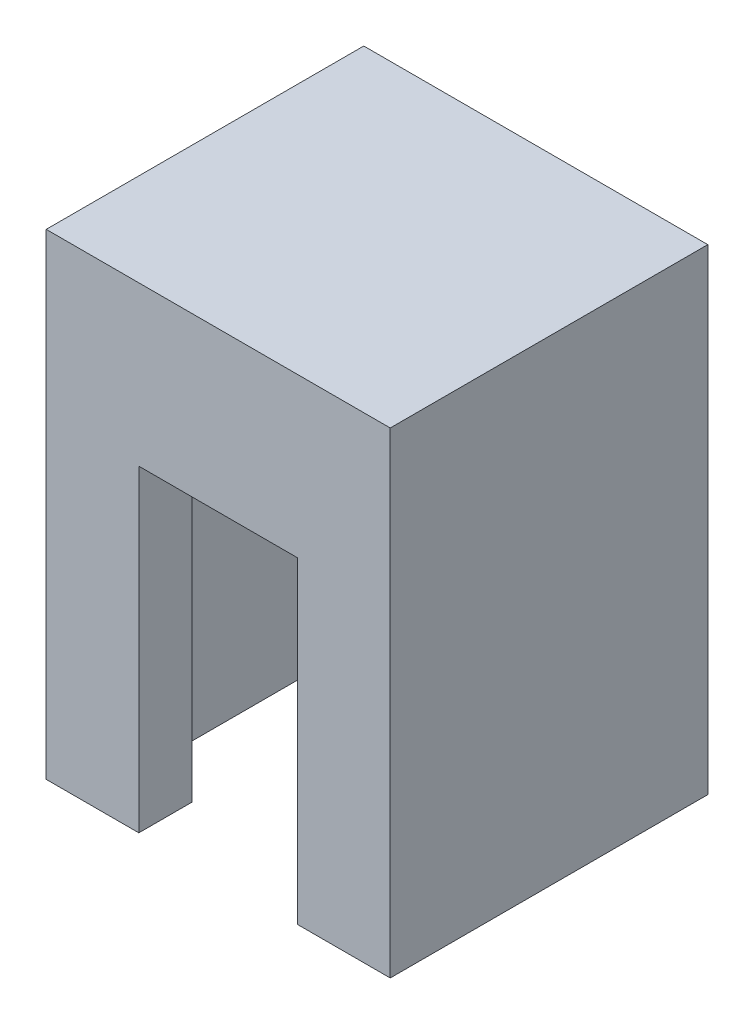
ISO-10303-21;
HEADER;
FILE_DESCRIPTION(('STEP AP214'),'2;1');
FILE_NAME('part.step','',(''),(''),'','','');
FILE_SCHEMA(('AUTOMOTIVE_DESIGN { 1 0 10303 214 1 1 1 1 }'));
ENDSEC;
DATA;
#1=APPLICATION_CONTEXT('core data for automotive mechanical design processes');
#2=APPLICATION_PROTOCOL_DEFINITION('international standard','automotive_design',2000,#1);
#3=PRODUCT_CONTEXT('',#1,'mechanical');
#4=PRODUCT('Part','Part','',(#3));
#5=PRODUCT_RELATED_PRODUCT_CATEGORY('part','',(#4));
#6=PRODUCT_DEFINITION_FORMATION('','',#4);
#7=PRODUCT_DEFINITION_CONTEXT('part definition',#1,'design');
#8=PRODUCT_DEFINITION('design','',#6,#7);
#9=PRODUCT_DEFINITION_SHAPE('','',#8);
#10=(LENGTH_UNIT() NAMED_UNIT(*) SI_UNIT(.MILLI.,.METRE.));
#11=(NAMED_UNIT(*) PLANE_ANGLE_UNIT() SI_UNIT($,.RADIAN.));
#12=(NAMED_UNIT(*) SI_UNIT($,.STERADIAN.) SOLID_ANGLE_UNIT());
#13=UNCERTAINTY_MEASURE_WITH_UNIT(LENGTH_MEASURE(1.E-05),#10,'distance_accuracy_value','');
#14=(GEOMETRIC_REPRESENTATION_CONTEXT(3) GLOBAL_UNCERTAINTY_ASSIGNED_CONTEXT((#13)) GLOBAL_UNIT_ASSIGNED_CONTEXT((#10,
#11,#12)) REPRESENTATION_CONTEXT('',''));
#15=CARTESIAN_POINT('',(0.,0.,0.));
#16=DIRECTION('',(0.,0.,1.));
#17=DIRECTION('',(1.,0.,0.));
#18=AXIS2_PLACEMENT_3D('',#15,#16,#17);
#19=CARTESIAN_POINT('',(-6.5,-9.,12.));
#20=DIRECTION('',(0.,1.,0.));
#21=DIRECTION('',(0.,0.,1.));
#22=AXIS2_PLACEMENT_3D('',#19,#20,#21);
#23=PLANE('',#22);
#24=DIRECTION('',(1.,0.,0.));
#25=VECTOR('',#24,1.);
#26=CARTESIAN_POINT('',(-6.5,-9.,0.));
#27=LINE('',#26,#25);
#28=CARTESIAN_POINT('',(-6.5,-9.,0.));
#29=VERTEX_POINT('',#28);
#30=CARTESIAN_POINT('',(-3.,-9.,0.));
#31=VERTEX_POINT('',#30);
#32=EDGE_CURVE('E255',#29,#31,#27,.T.);
#33=ORIENTED_EDGE('',*,*,#32,.T.);
#34=DIRECTION('',(0.,0.,-1.));
#35=VECTOR('',#34,1.);
#36=CARTESIAN_POINT('',(-3.,-9.,2.));
#37=LINE('',#36,#35);
#38=CARTESIAN_POINT('',(-3.,-9.,2.));
#39=VERTEX_POINT('',#38);
#40=EDGE_CURVE('E223',#39,#31,#37,.T.);
#41=ORIENTED_EDGE('',*,*,#40,.F.);
#42=DIRECTION('',(1.,0.,0.));
#43=VECTOR('',#42,1.);
#44=CARTESIAN_POINT('',(-5.,-9.,2.));
#45=LINE('',#44,#43);
#46=CARTESIAN_POINT('',(-5.,-9.,2.));
#47=VERTEX_POINT('',#46);
#48=EDGE_CURVE('E220',#47,#39,#45,.T.);
#49=ORIENTED_EDGE('',*,*,#48,.F.);
#50=DIRECTION('',(0.,0.,-1.));
#51=VECTOR('',#50,1.);
#52=CARTESIAN_POINT('',(-5.,-9.,2.));
#53=LINE('',#52,#51);
#54=CARTESIAN_POINT('',(-5.,-9.,10.));
#55=VERTEX_POINT('',#54);
#56=EDGE_CURVE('E217',#55,#47,#53,.T.);
#57=ORIENTED_EDGE('',*,*,#56,.F.);
#58=DIRECTION('',(-1.,0.,0.));
#59=VECTOR('',#58,1.);
#60=CARTESIAN_POINT('',(-5.,-9.,10.));
#61=LINE('',#60,#59);
#62=CARTESIAN_POINT('',(-3.,-9.,10.));
#63=VERTEX_POINT('',#62);
#64=EDGE_CURVE('E214',#63,#55,#61,.T.);
#65=ORIENTED_EDGE('',*,*,#64,.F.);
#66=DIRECTION('',(0.,0.,-1.));
#67=VECTOR('',#66,1.);
#68=CARTESIAN_POINT('',(-3.,-9.,10.));
#69=LINE('',#68,#67);
#70=CARTESIAN_POINT('',(-3.,-9.,12.));
#71=VERTEX_POINT('',#70);
#72=EDGE_CURVE('E211',#71,#63,#69,.T.);
#73=ORIENTED_EDGE('',*,*,#72,.F.);
#74=DIRECTION('',(1.,0.,0.));
#75=VECTOR('',#74,1.);
#76=CARTESIAN_POINT('',(-6.5,-9.,12.));
#77=LINE('',#76,#75);
#78=CARTESIAN_POINT('',(-6.5,-9.,12.));
#79=VERTEX_POINT('',#78);
#80=EDGE_CURVE('E259',#79,#71,#77,.T.);
#81=ORIENTED_EDGE('',*,*,#80,.F.);
#82=DIRECTION('',(0.,0.,-1.));
#83=VECTOR('',#82,1.);
#84=CARTESIAN_POINT('',(-6.5,-9.,12.));
#85=LINE('',#84,#83);
#86=EDGE_CURVE('E272',#79,#29,#85,.T.);
#87=ORIENTED_EDGE('',*,*,#86,.T.);
#88=EDGE_LOOP('',(#33,#41,#49,#57,#65,#73,#81,#87));
#89=FACE_BOUND('',#88,.T.);
#90=ADVANCED_FACE('F33',(#89),#23,.F.);
#91=CARTESIAN_POINT('',(6.5,-9.,12.));
#92=DIRECTION('',(-1.,0.,0.));
#93=DIRECTION('',(0.,0.,1.));
#94=AXIS2_PLACEMENT_3D('',#91,#92,#93);
#95=PLANE('',#94);
#96=DIRECTION('',(0.,1.,0.));
#97=VECTOR('',#96,1.);
#98=CARTESIAN_POINT('',(6.5,-9.,0.));
#99=LINE('',#98,#97);
#100=CARTESIAN_POINT('',(6.5,-9.,0.));
#101=VERTEX_POINT('',#100);
#102=CARTESIAN_POINT('',(6.5,9.,0.));
#103=VERTEX_POINT('',#102);
#104=EDGE_CURVE('E232',#101,#103,#99,.T.);
#105=ORIENTED_EDGE('',*,*,#104,.T.);
#106=DIRECTION('',(0.,0.,-1.));
#107=VECTOR('',#106,1.);
#108=CARTESIAN_POINT('',(6.5,9.,12.));
#109=LINE('',#108,#107);
#110=CARTESIAN_POINT('',(6.5,9.,12.));
#111=VERTEX_POINT('',#110);
#112=EDGE_CURVE('E11',#111,#103,#109,.T.);
#113=ORIENTED_EDGE('',*,*,#112,.F.);
#114=DIRECTION('',(0.,1.,0.));
#115=VECTOR('',#114,1.);
#116=CARTESIAN_POINT('',(6.5,-9.,12.));
#117=LINE('',#116,#115);
#118=CARTESIAN_POINT('',(6.5,-9.,12.));
#119=VERTEX_POINT('',#118);
#120=EDGE_CURVE('E253',#119,#111,#117,.T.);
#121=ORIENTED_EDGE('',*,*,#120,.F.);
#122=DIRECTION('',(0.,0.,-1.));
#123=VECTOR('',#122,1.);
#124=CARTESIAN_POINT('',(6.5,-9.,12.));
#125=LINE('',#124,#123);
#126=EDGE_CURVE('E262',#119,#101,#125,.T.);
#127=ORIENTED_EDGE('',*,*,#126,.T.);
#128=EDGE_LOOP('',(#105,#113,#121,#127));
#129=FACE_BOUND('',#128,.T.);
#130=ADVANCED_FACE('F35',(#129),#95,.F.);
#131=CARTESIAN_POINT('',(-6.5,9.,12.));
#132=DIRECTION('',(0.,-1.,0.));
#133=DIRECTION('',(0.,0.,-1.));
#134=AXIS2_PLACEMENT_3D('',#131,#132,#133);
#135=PLANE('',#134);
#136=DIRECTION('',(-1.,0.,0.));
#137=VECTOR('',#136,1.);
#138=CARTESIAN_POINT('',(-6.5,9.,0.));
#139=LINE('',#138,#137);
#140=CARTESIAN_POINT('',(-6.5,9.,0.));
#141=VERTEX_POINT('',#140);
#142=EDGE_CURVE('E265',#103,#141,#139,.T.);
#143=ORIENTED_EDGE('',*,*,#142,.T.);
#144=DIRECTION('',(0.,0.,-1.));
#145=VECTOR('',#144,1.);
#146=CARTESIAN_POINT('',(-6.5,9.,12.));
#147=LINE('',#146,#145);
#148=CARTESIAN_POINT('',(-6.5,9.,12.));
#149=VERTEX_POINT('',#148);
#150=EDGE_CURVE('E41',#149,#141,#147,.T.);
#151=ORIENTED_EDGE('',*,*,#150,.F.);
#152=DIRECTION('',(-1.,0.,0.));
#153=VECTOR('',#152,1.);
#154=CARTESIAN_POINT('',(-6.5,9.,12.));
#155=LINE('',#154,#153);
#156=EDGE_CURVE('E86',#111,#149,#155,.T.);
#157=ORIENTED_EDGE('',*,*,#156,.F.);
#158=ORIENTED_EDGE('',*,*,#112,.T.);
#159=EDGE_LOOP('',(#143,#151,#157,#158));
#160=FACE_BOUND('',#159,.T.);
#161=ADVANCED_FACE('F297',(#160),#135,.F.);
#162=CARTESIAN_POINT('',(-6.5,-9.,12.));
#163=DIRECTION('',(1.,0.,0.));
#164=DIRECTION('',(0.,0.,-1.));
#165=AXIS2_PLACEMENT_3D('',#162,#163,#164);
#166=PLANE('',#165);
#167=DIRECTION('',(0.,-1.,0.));
#168=VECTOR('',#167,1.);
#169=CARTESIAN_POINT('',(-6.5,-9.,0.));
#170=LINE('',#169,#168);
#171=EDGE_CURVE('E267',#141,#29,#170,.T.);
#172=ORIENTED_EDGE('',*,*,#171,.T.);
#173=ORIENTED_EDGE('',*,*,#86,.F.);
#174=DIRECTION('',(0.,-1.,0.));
#175=VECTOR('',#174,1.);
#176=CARTESIAN_POINT('',(-6.5,-9.,12.));
#177=LINE('',#176,#175);
#178=EDGE_CURVE('E257',#149,#79,#177,.T.);
#179=ORIENTED_EDGE('',*,*,#178,.F.);
#180=ORIENTED_EDGE('',*,*,#150,.T.);
#181=EDGE_LOOP('',(#172,#173,#179,#180));
#182=FACE_BOUND('',#181,.T.);
#183=ADVANCED_FACE('F278',(#182),#166,.F.);
#184=DIRECTION('',(1.,0.,0.));
#185=VECTOR('',#184,1.);
#186=CARTESIAN_POINT('',(5.,-9.,2.));
#187=LINE('',#186,#185);
#188=CARTESIAN_POINT('',(2.99999999999999,-9.,2.));
#189=VERTEX_POINT('',#188);
#190=CARTESIAN_POINT('',(5.,-9.,2.));
#191=VERTEX_POINT('',#190);
#192=EDGE_CURVE('E184',#189,#191,#187,.T.);
#193=ORIENTED_EDGE('',*,*,#192,.F.);
#194=DIRECTION('',(0.,0.,1.));
#195=VECTOR('',#194,1.);
#196=CARTESIAN_POINT('',(2.99999999999999,-9.,0.));
#197=LINE('',#196,#195);
#198=CARTESIAN_POINT('',(2.99999999999999,-9.,0.));
#199=VERTEX_POINT('',#198);
#200=EDGE_CURVE('E225',#199,#189,#197,.T.);
#201=ORIENTED_EDGE('',*,*,#200,.F.);
#202=EDGE_CURVE('E79',#199,#101,#27,.T.);
#203=ORIENTED_EDGE('',*,*,#202,.T.);
#204=ORIENTED_EDGE('',*,*,#126,.F.);
#205=CARTESIAN_POINT('',(3.,-9.,12.));
#206=VERTEX_POINT('',#205);
#207=EDGE_CURVE('E57',#206,#119,#77,.T.);
#208=ORIENTED_EDGE('',*,*,#207,.F.);
#209=DIRECTION('',(0.,0.,1.));
#210=VECTOR('',#209,1.);
#211=CARTESIAN_POINT('',(3.,-9.,12.));
#212=LINE('',#211,#210);
#213=CARTESIAN_POINT('',(3.,-9.,10.));
#214=VERTEX_POINT('',#213);
#215=EDGE_CURVE('E209',#214,#206,#212,.T.);
#216=ORIENTED_EDGE('',*,*,#215,.F.);
#217=DIRECTION('',(-1.,0.,0.));
#218=VECTOR('',#217,1.);
#219=CARTESIAN_POINT('',(5.,-9.,10.));
#220=LINE('',#219,#218);
#221=CARTESIAN_POINT('',(5.,-9.,10.));
#222=VERTEX_POINT('',#221);
#223=EDGE_CURVE('E165',#222,#214,#220,.T.);
#224=ORIENTED_EDGE('',*,*,#223,.F.);
#225=DIRECTION('',(0.,0.,1.));
#226=VECTOR('',#225,1.);
#227=CARTESIAN_POINT('',(5.,-9.,2.));
#228=LINE('',#227,#226);
#229=EDGE_CURVE('E181',#191,#222,#228,.T.);
#230=ORIENTED_EDGE('',*,*,#229,.F.);
#231=EDGE_LOOP('',(#193,#201,#203,#204,#208,#216,#224,#230));
#232=FACE_BOUND('',#231,.T.);
#233=ADVANCED_FACE('F303',(#232),#23,.F.);
#234=CARTESIAN_POINT('',(0.,0.,12.));
#235=DIRECTION('',(0.,0.,-1.));
#236=DIRECTION('',(-1.,0.,0.));
#237=AXIS2_PLACEMENT_3D('',#234,#235,#236);
#238=PLANE('',#237);
#239=ORIENTED_EDGE('',*,*,#80,.T.);
#240=DIRECTION('',(0.,-1.,0.));
#241=VECTOR('',#240,1.);
#242=CARTESIAN_POINT('',(-3.,3.,12.));
#243=LINE('',#242,#241);
#244=CARTESIAN_POINT('',(-3.,3.,12.));
#245=VERTEX_POINT('',#244);
#246=EDGE_CURVE('E250',#245,#71,#243,.T.);
#247=ORIENTED_EDGE('',*,*,#246,.F.);
#248=DIRECTION('',(-1.,0.,0.));
#249=VECTOR('',#248,1.);
#250=CARTESIAN_POINT('',(-3.,3.,12.));
#251=LINE('',#250,#249);
#252=CARTESIAN_POINT('',(3.,3.,12.));
#253=VERTEX_POINT('',#252);
#254=EDGE_CURVE('E176',#253,#245,#251,.T.);
#255=ORIENTED_EDGE('',*,*,#254,.F.);
#256=DIRECTION('',(0.,-1.,0.));
#257=VECTOR('',#256,1.);
#258=CARTESIAN_POINT('',(3.,3.,12.));
#259=LINE('',#258,#257);
#260=EDGE_CURVE('E168',#253,#206,#259,.T.);
#261=ORIENTED_EDGE('',*,*,#260,.T.);
#262=ORIENTED_EDGE('',*,*,#207,.T.);
#263=ORIENTED_EDGE('',*,*,#120,.T.);
#264=ORIENTED_EDGE('',*,*,#156,.T.);
#265=ORIENTED_EDGE('',*,*,#178,.T.);
#266=EDGE_LOOP('',(#239,#247,#255,#261,#262,#263,#264,#265));
#267=FACE_BOUND('',#266,.T.);
#268=ADVANCED_FACE('F293',(#267),#238,.F.);
#269=CARTESIAN_POINT('',(0.,0.,0.));
#270=DIRECTION('',(0.,0.,-1.));
#271=DIRECTION('',(-1.,0.,0.));
#272=AXIS2_PLACEMENT_3D('',#269,#270,#271);
#273=PLANE('',#272);
#274=DIRECTION('',(0.,-1.,0.));
#275=VECTOR('',#274,1.);
#276=CARTESIAN_POINT('',(2.99999999999999,3.,0.));
#277=LINE('',#276,#275);
#278=CARTESIAN_POINT('',(2.99999999999999,3.,0.));
#279=VERTEX_POINT('',#278);
#280=EDGE_CURVE('E237',#279,#199,#277,.T.);
#281=ORIENTED_EDGE('',*,*,#280,.F.);
#282=DIRECTION('',(1.,0.,0.));
#283=VECTOR('',#282,1.);
#284=CARTESIAN_POINT('',(-3.,3.,0.));
#285=LINE('',#284,#283);
#286=CARTESIAN_POINT('',(-3.,3.,0.));
#287=VERTEX_POINT('',#286);
#288=EDGE_CURVE('E200',#287,#279,#285,.T.);
#289=ORIENTED_EDGE('',*,*,#288,.F.);
#290=DIRECTION('',(0.,-1.,0.));
#291=VECTOR('',#290,1.);
#292=CARTESIAN_POINT('',(-3.,3.,0.));
#293=LINE('',#292,#291);
#294=EDGE_CURVE('E239',#287,#31,#293,.T.);
#295=ORIENTED_EDGE('',*,*,#294,.T.);
#296=ORIENTED_EDGE('',*,*,#32,.F.);
#297=ORIENTED_EDGE('',*,*,#171,.F.);
#298=ORIENTED_EDGE('',*,*,#142,.F.);
#299=ORIENTED_EDGE('',*,*,#104,.F.);
#300=ORIENTED_EDGE('',*,*,#202,.F.);
#301=EDGE_LOOP('',(#281,#289,#295,#296,#297,#298,#299,#300));
#302=FACE_BOUND('',#301,.T.);
#303=ADVANCED_FACE('F283',(#302),#273,.T.);
#304=CARTESIAN_POINT('',(5.,3.,10.));
#305=DIRECTION('',(0.,0.,1.));
#306=DIRECTION('',(1.,0.,0.));
#307=AXIS2_PLACEMENT_3D('',#304,#305,#306);
#308=PLANE('',#307);
#309=ORIENTED_EDGE('',*,*,#223,.T.);
#310=DIRECTION('',(0.,-1.,0.));
#311=VECTOR('',#310,1.);
#312=CARTESIAN_POINT('',(3.,3.,10.));
#313=LINE('',#312,#311);
#314=CARTESIAN_POINT('',(3.,3.,10.));
#315=VERTEX_POINT('',#314);
#316=EDGE_CURVE('E158',#315,#214,#313,.T.);
#317=ORIENTED_EDGE('',*,*,#316,.F.);
#318=DIRECTION('',(-1.,0.,0.));
#319=VECTOR('',#318,1.);
#320=CARTESIAN_POINT('',(5.,3.,10.));
#321=LINE('',#320,#319);
#322=CARTESIAN_POINT('',(5.,3.,10.));
#323=VERTEX_POINT('',#322);
#324=EDGE_CURVE('E162',#323,#315,#321,.T.);
#325=ORIENTED_EDGE('',*,*,#324,.F.);
#326=DIRECTION('',(0.,-1.,0.));
#327=VECTOR('',#326,1.);
#328=CARTESIAN_POINT('',(5.,3.,10.));
#329=LINE('',#328,#327);
#330=EDGE_CURVE('E230',#323,#222,#329,.T.);
#331=ORIENTED_EDGE('',*,*,#330,.T.);
#332=EDGE_LOOP('',(#309,#317,#325,#331));
#333=FACE_BOUND('',#332,.T.);
#334=ADVANCED_FACE('F160',(#333),#308,.F.);
#335=CARTESIAN_POINT('',(5.,3.,2.));
#336=DIRECTION('',(1.,0.,0.));
#337=DIRECTION('',(0.,0.,-1.));
#338=AXIS2_PLACEMENT_3D('',#335,#336,#337);
#339=PLANE('',#338);
#340=ORIENTED_EDGE('',*,*,#229,.T.);
#341=ORIENTED_EDGE('',*,*,#330,.F.);
#342=DIRECTION('',(0.,0.,1.));
#343=VECTOR('',#342,1.);
#344=CARTESIAN_POINT('',(5.,3.,2.));
#345=LINE('',#344,#343);
#346=CARTESIAN_POINT('',(5.,3.,2.));
#347=VERTEX_POINT('',#346);
#348=EDGE_CURVE('E169',#347,#323,#345,.T.);
#349=ORIENTED_EDGE('',*,*,#348,.F.);
#350=DIRECTION('',(0.,-1.,0.));
#351=VECTOR('',#350,1.);
#352=CARTESIAN_POINT('',(5.,3.,2.));
#353=LINE('',#352,#351);
#354=EDGE_CURVE('E233',#347,#191,#353,.T.);
#355=ORIENTED_EDGE('',*,*,#354,.T.);
#356=EDGE_LOOP('',(#340,#341,#349,#355));
#357=FACE_BOUND('',#356,.T.);
#358=ADVANCED_FACE('F323',(#357),#339,.F.);
#359=CARTESIAN_POINT('',(5.,3.,2.));
#360=DIRECTION('',(0.,0.,-1.));
#361=DIRECTION('',(-1.,0.,0.));
#362=AXIS2_PLACEMENT_3D('',#359,#360,#361);
#363=PLANE('',#362);
#364=ORIENTED_EDGE('',*,*,#192,.T.);
#365=ORIENTED_EDGE('',*,*,#354,.F.);
#366=DIRECTION('',(1.,0.,0.));
#367=VECTOR('',#366,1.);
#368=CARTESIAN_POINT('',(5.,3.,2.));
#369=LINE('',#368,#367);
#370=CARTESIAN_POINT('',(2.99999999999999,3.,2.));
#371=VERTEX_POINT('',#370);
#372=EDGE_CURVE('E205',#371,#347,#369,.T.);
#373=ORIENTED_EDGE('',*,*,#372,.F.);
#374=DIRECTION('',(0.,-1.,0.));
#375=VECTOR('',#374,1.);
#376=CARTESIAN_POINT('',(2.99999999999999,3.,2.));
#377=LINE('',#376,#375);
#378=EDGE_CURVE('E235',#371,#189,#377,.T.);
#379=ORIENTED_EDGE('',*,*,#378,.T.);
#380=EDGE_LOOP('',(#364,#365,#373,#379));
#381=FACE_BOUND('',#380,.T.);
#382=ADVANCED_FACE('F318',(#381),#363,.F.);
#383=CARTESIAN_POINT('',(2.99999999999999,3.,0.));
#384=DIRECTION('',(1.,0.,0.));
#385=DIRECTION('',(0.,0.,-1.));
#386=AXIS2_PLACEMENT_3D('',#383,#384,#385);
#387=PLANE('',#386);
#388=ORIENTED_EDGE('',*,*,#200,.T.);
#389=ORIENTED_EDGE('',*,*,#378,.F.);
#390=DIRECTION('',(0.,0.,1.));
#391=VECTOR('',#390,1.);
#392=CARTESIAN_POINT('',(2.99999999999999,3.,0.));
#393=LINE('',#392,#391);
#394=EDGE_CURVE('E202',#279,#371,#393,.T.);
#395=ORIENTED_EDGE('',*,*,#394,.F.);
#396=ORIENTED_EDGE('',*,*,#280,.T.);
#397=EDGE_LOOP('',(#388,#389,#395,#396));
#398=FACE_BOUND('',#397,.T.);
#399=ADVANCED_FACE('F321',(#398),#387,.F.);
#400=CARTESIAN_POINT('',(-3.,3.,2.));
#401=DIRECTION('',(-1.,0.,0.));
#402=DIRECTION('',(0.,0.,1.));
#403=AXIS2_PLACEMENT_3D('',#400,#401,#402);
#404=PLANE('',#403);
#405=ORIENTED_EDGE('',*,*,#40,.T.);
#406=ORIENTED_EDGE('',*,*,#294,.F.);
#407=DIRECTION('',(0.,0.,-1.));
#408=VECTOR('',#407,1.);
#409=CARTESIAN_POINT('',(-3.,3.,2.));
#410=LINE('',#409,#408);
#411=CARTESIAN_POINT('',(-3.,3.,2.));
#412=VERTEX_POINT('',#411);
#413=EDGE_CURVE('E48',#412,#287,#410,.T.);
#414=ORIENTED_EDGE('',*,*,#413,.F.);
#415=DIRECTION('',(0.,-1.,0.));
#416=VECTOR('',#415,1.);
#417=CARTESIAN_POINT('',(-3.,3.,2.));
#418=LINE('',#417,#416);
#419=EDGE_CURVE('E242',#412,#39,#418,.T.);
#420=ORIENTED_EDGE('',*,*,#419,.T.);
#421=EDGE_LOOP('',(#405,#406,#414,#420));
#422=FACE_BOUND('',#421,.T.);
#423=ADVANCED_FACE('F337',(#422),#404,.F.);
#424=CARTESIAN_POINT('',(-5.,3.,2.));
#425=DIRECTION('',(0.,0.,-1.));
#426=DIRECTION('',(-1.,0.,0.));
#427=AXIS2_PLACEMENT_3D('',#424,#425,#426);
#428=PLANE('',#427);
#429=ORIENTED_EDGE('',*,*,#48,.T.);
#430=ORIENTED_EDGE('',*,*,#419,.F.);
#431=DIRECTION('',(1.,0.,0.));
#432=VECTOR('',#431,1.);
#433=CARTESIAN_POINT('',(-5.,3.,2.));
#434=LINE('',#433,#432);
#435=CARTESIAN_POINT('',(-5.,3.,2.));
#436=VERTEX_POINT('',#435);
#437=EDGE_CURVE('E197',#436,#412,#434,.T.);
#438=ORIENTED_EDGE('',*,*,#437,.F.);
#439=DIRECTION('',(0.,-1.,0.));
#440=VECTOR('',#439,1.);
#441=CARTESIAN_POINT('',(-5.,3.,2.));
#442=LINE('',#441,#440);
#443=EDGE_CURVE('E244',#436,#47,#442,.T.);
#444=ORIENTED_EDGE('',*,*,#443,.T.);
#445=EDGE_LOOP('',(#429,#430,#438,#444));
#446=FACE_BOUND('',#445,.T.);
#447=ADVANCED_FACE('F335',(#446),#428,.F.);
#448=CARTESIAN_POINT('',(-5.,3.,2.));
#449=DIRECTION('',(-1.,0.,0.));
#450=DIRECTION('',(0.,0.,1.));
#451=AXIS2_PLACEMENT_3D('',#448,#449,#450);
#452=PLANE('',#451);
#453=ORIENTED_EDGE('',*,*,#56,.T.);
#454=ORIENTED_EDGE('',*,*,#443,.F.);
#455=DIRECTION('',(0.,0.,-1.));
#456=VECTOR('',#455,1.);
#457=CARTESIAN_POINT('',(-5.,3.,2.));
#458=LINE('',#457,#456);
#459=CARTESIAN_POINT('',(-5.,3.,10.));
#460=VERTEX_POINT('',#459);
#461=EDGE_CURVE('E194',#460,#436,#458,.T.);
#462=ORIENTED_EDGE('',*,*,#461,.F.);
#463=DIRECTION('',(0.,-1.,0.));
#464=VECTOR('',#463,1.);
#465=CARTESIAN_POINT('',(-5.,3.,10.));
#466=LINE('',#465,#464);
#467=EDGE_CURVE('E246',#460,#55,#466,.T.);
#468=ORIENTED_EDGE('',*,*,#467,.T.);
#469=EDGE_LOOP('',(#453,#454,#462,#468));
#470=FACE_BOUND('',#469,.T.);
#471=ADVANCED_FACE('F332',(#470),#452,.F.);
#472=CARTESIAN_POINT('',(-5.,3.,10.));
#473=DIRECTION('',(0.,0.,1.));
#474=DIRECTION('',(1.,0.,0.));
#475=AXIS2_PLACEMENT_3D('',#472,#473,#474);
#476=PLANE('',#475);
#477=ORIENTED_EDGE('',*,*,#64,.T.);
#478=ORIENTED_EDGE('',*,*,#467,.F.);
#479=DIRECTION('',(-1.,0.,0.));
#480=VECTOR('',#479,1.);
#481=CARTESIAN_POINT('',(-5.,3.,10.));
#482=LINE('',#481,#480);
#483=CARTESIAN_POINT('',(-3.,3.,10.));
#484=VERTEX_POINT('',#483);
#485=EDGE_CURVE('E191',#484,#460,#482,.T.);
#486=ORIENTED_EDGE('',*,*,#485,.F.);
#487=DIRECTION('',(0.,-1.,0.));
#488=VECTOR('',#487,1.);
#489=CARTESIAN_POINT('',(-3.,3.,10.));
#490=LINE('',#489,#488);
#491=EDGE_CURVE('E248',#484,#63,#490,.T.);
#492=ORIENTED_EDGE('',*,*,#491,.T.);
#493=EDGE_LOOP('',(#477,#478,#486,#492));
#494=FACE_BOUND('',#493,.T.);
#495=ADVANCED_FACE('F328',(#494),#476,.F.);
#496=CARTESIAN_POINT('',(-3.,3.,10.));
#497=DIRECTION('',(-1.,0.,0.));
#498=DIRECTION('',(0.,0.,1.));
#499=AXIS2_PLACEMENT_3D('',#496,#497,#498);
#500=PLANE('',#499);
#501=ORIENTED_EDGE('',*,*,#72,.T.);
#502=ORIENTED_EDGE('',*,*,#491,.F.);
#503=DIRECTION('',(0.,0.,-1.));
#504=VECTOR('',#503,1.);
#505=CARTESIAN_POINT('',(-3.,3.,10.));
#506=LINE('',#505,#504);
#507=EDGE_CURVE('E188',#245,#484,#506,.T.);
#508=ORIENTED_EDGE('',*,*,#507,.F.);
#509=ORIENTED_EDGE('',*,*,#246,.T.);
#510=EDGE_LOOP('',(#501,#502,#508,#509));
#511=FACE_BOUND('',#510,.T.);
#512=ADVANCED_FACE('F326',(#511),#500,.F.);
#513=CARTESIAN_POINT('',(3.,3.,12.));
#514=DIRECTION('',(1.,0.,0.));
#515=DIRECTION('',(0.,0.,-1.));
#516=AXIS2_PLACEMENT_3D('',#513,#514,#515);
#517=PLANE('',#516);
#518=ORIENTED_EDGE('',*,*,#215,.T.);
#519=ORIENTED_EDGE('',*,*,#260,.F.);
#520=DIRECTION('',(0.,0.,1.));
#521=VECTOR('',#520,1.);
#522=CARTESIAN_POINT('',(3.,3.,12.));
#523=LINE('',#522,#521);
#524=EDGE_CURVE('E172',#315,#253,#523,.T.);
#525=ORIENTED_EDGE('',*,*,#524,.F.);
#526=ORIENTED_EDGE('',*,*,#316,.T.);
#527=EDGE_LOOP('',(#518,#519,#525,#526));
#528=FACE_BOUND('',#527,.T.);
#529=ADVANCED_FACE('F173',(#528),#517,.F.);
#530=CARTESIAN_POINT('',(0.,3.,0.));
#531=DIRECTION('',(0.,-1.,0.));
#532=DIRECTION('',(0.,0.,-1.));
#533=AXIS2_PLACEMENT_3D('',#530,#531,#532);
#534=PLANE('',#533);
#535=ORIENTED_EDGE('',*,*,#324,.T.);
#536=ORIENTED_EDGE('',*,*,#524,.T.);
#537=ORIENTED_EDGE('',*,*,#254,.T.);
#538=ORIENTED_EDGE('',*,*,#507,.T.);
#539=ORIENTED_EDGE('',*,*,#485,.T.);
#540=ORIENTED_EDGE('',*,*,#461,.T.);
#541=ORIENTED_EDGE('',*,*,#437,.T.);
#542=ORIENTED_EDGE('',*,*,#413,.T.);
#543=ORIENTED_EDGE('',*,*,#288,.T.);
#544=ORIENTED_EDGE('',*,*,#394,.T.);
#545=ORIENTED_EDGE('',*,*,#372,.T.);
#546=ORIENTED_EDGE('',*,*,#348,.T.);
#547=EDGE_LOOP('',(#535,#536,#537,#538,#539,#540,#541,#542,#543,#544,#545,#546));
#548=FACE_BOUND('',#547,.T.);
#549=ADVANCED_FACE('F178',(#548),#534,.T.);
#550=CLOSED_SHELL('',(#90,#130,#161,#183,#233,#268,#303,#334,#358,#382,#399,#423,#447,#471,#495,
#512,#529,#549));
#551=MANIFOLD_SOLID_BREP('B2',#550);
#552=ADVANCED_BREP_SHAPE_REPRESENTATION('',(#18,#551),#14);
#553=SHAPE_DEFINITION_REPRESENTATION(#9,#552);
ENDSEC;
END-ISO-10303-21;
